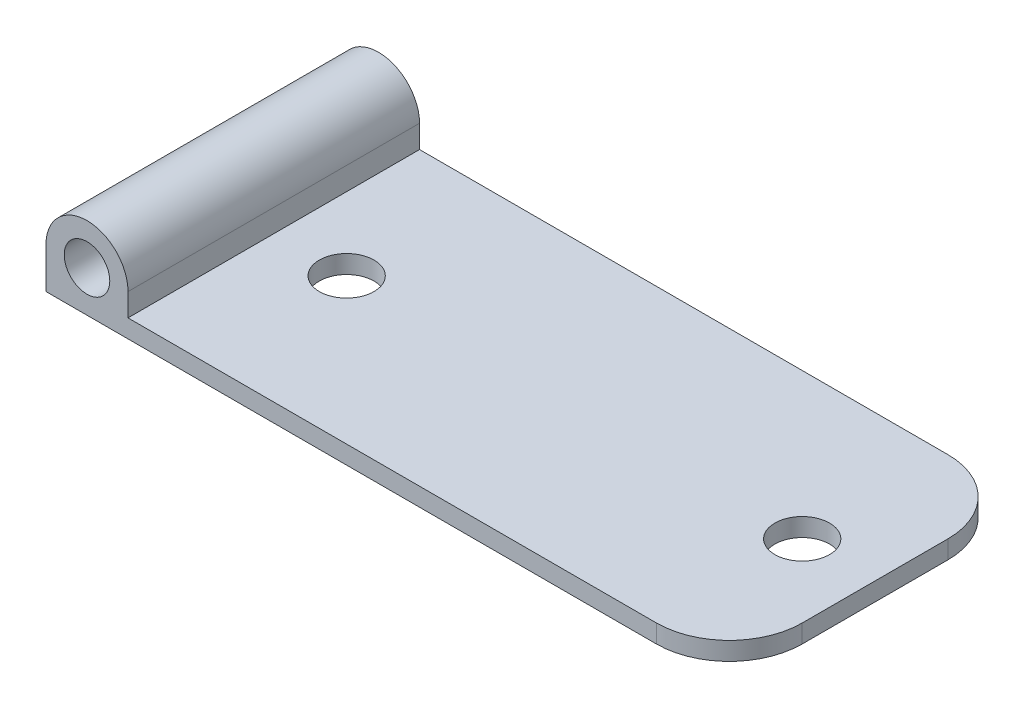
ISO-10303-21;
HEADER;
FILE_DESCRIPTION(('STEP AP214'),'2;1');
FILE_NAME('part.step','',(''),(''),'','','');
FILE_SCHEMA(('AUTOMOTIVE_DESIGN { 1 0 10303 214 1 1 1 1 }'));
ENDSEC;
DATA;
#1=APPLICATION_CONTEXT('core data for automotive mechanical design processes');
#2=APPLICATION_PROTOCOL_DEFINITION('international standard','automotive_design',2000,#1);
#3=PRODUCT_CONTEXT('',#1,'mechanical');
#4=PRODUCT('Part','Part','',(#3));
#5=PRODUCT_RELATED_PRODUCT_CATEGORY('part','',(#4));
#6=PRODUCT_DEFINITION_FORMATION('','',#4);
#7=PRODUCT_DEFINITION_CONTEXT('part definition',#1,'design');
#8=PRODUCT_DEFINITION('design','',#6,#7);
#9=PRODUCT_DEFINITION_SHAPE('','',#8);
#10=(LENGTH_UNIT() NAMED_UNIT(*) SI_UNIT(.MILLI.,.METRE.));
#11=(NAMED_UNIT(*) PLANE_ANGLE_UNIT() SI_UNIT($,.RADIAN.));
#12=(NAMED_UNIT(*) SI_UNIT($,.STERADIAN.) SOLID_ANGLE_UNIT());
#13=UNCERTAINTY_MEASURE_WITH_UNIT(LENGTH_MEASURE(1.E-05),#10,'distance_accuracy_value','');
#14=(GEOMETRIC_REPRESENTATION_CONTEXT(3) GLOBAL_UNCERTAINTY_ASSIGNED_CONTEXT((#13)) GLOBAL_UNIT_ASSIGNED_CONTEXT((#10,
#11,#12)) REPRESENTATION_CONTEXT('',''));
#15=CARTESIAN_POINT('',(0.,0.,0.));
#16=DIRECTION('',(0.,0.,1.));
#17=DIRECTION('',(1.,0.,0.));
#18=AXIS2_PLACEMENT_3D('',#15,#16,#17);
#19=CARTESIAN_POINT('',(-7.14375,0.,50.8));
#20=DIRECTION('',(1.,0.,0.));
#21=DIRECTION('',(0.,1.,0.));
#22=AXIS2_PLACEMENT_3D('',#19,#20,#21);
#23=PLANE('',#22);
#24=DIRECTION('',(0.,-1.,0.));
#25=VECTOR('',#24,1.);
#26=CARTESIAN_POINT('',(-7.14375,0.,0.));
#27=LINE('',#26,#25);
#28=CARTESIAN_POINT('',(-7.14375,0.,0.));
#29=VERTEX_POINT('',#28);
#30=CARTESIAN_POINT('',(-7.14375,-7.14375,0.));
#31=VERTEX_POINT('',#30);
#32=EDGE_CURVE('E126',#29,#31,#27,.T.);
#33=ORIENTED_EDGE('',*,*,#32,.T.);
#34=DIRECTION('',(0.,0.,-1.));
#35=VECTOR('',#34,1.);
#36=CARTESIAN_POINT('',(-7.14375,-7.14375,50.8));
#37=LINE('',#36,#35);
#38=CARTESIAN_POINT('',(-7.14375,-7.14375,50.8));
#39=VERTEX_POINT('',#38);
#40=EDGE_CURVE('E109',#39,#31,#37,.T.);
#41=ORIENTED_EDGE('',*,*,#40,.F.);
#42=DIRECTION('',(0.,-1.,0.));
#43=VECTOR('',#42,1.);
#44=CARTESIAN_POINT('',(-7.14375,0.,50.8));
#45=LINE('',#44,#43);
#46=CARTESIAN_POINT('',(-7.14375,0.,50.8));
#47=VERTEX_POINT('',#46);
#48=EDGE_CURVE('E114',#47,#39,#45,.T.);
#49=ORIENTED_EDGE('',*,*,#48,.F.);
#50=DIRECTION('',(0.,0.,-1.));
#51=VECTOR('',#50,1.);
#52=CARTESIAN_POINT('',(-7.14375,0.,50.8));
#53=LINE('',#52,#51);
#54=EDGE_CURVE('E172',#47,#29,#53,.T.);
#55=ORIENTED_EDGE('',*,*,#54,.T.);
#56=EDGE_LOOP('',(#33,#41,#49,#55));
#57=FACE_BOUND('',#56,.T.);
#58=ADVANCED_FACE('F38',(#57),#23,.F.);
#59=CARTESIAN_POINT('',(0.,-7.14375,50.8));
#60=DIRECTION('',(0.,1.,0.));
#61=DIRECTION('',(-1.,0.,0.));
#62=AXIS2_PLACEMENT_3D('',#59,#60,#61);
#63=PLANE('',#62);
#64=CARTESIAN_POINT('',(19.84375,-7.14375000000001,25.4));
#65=DIRECTION('',(0.,1.,0.));
#66=DIRECTION('',(-1.,0.,0.));
#67=AXIS2_PLACEMENT_3D('',#64,#65,#66);
#68=CIRCLE('',#67,4.76250000000001);
#69=CARTESIAN_POINT('',(15.08125,-7.14375000000001,25.4));
#70=VERTEX_POINT('',#69);
#71=EDGE_CURVE('E176',#70,#70,#68,.T.);
#72=ORIENTED_EDGE('',*,*,#71,.T.);
#73=EDGE_LOOP('',(#72));
#74=FACE_BOUND('',#73,.T.);
#75=CARTESIAN_POINT('',(99.21875,-7.14375000000005,25.4));
#76=DIRECTION('',(0.,1.,0.));
#77=DIRECTION('',(-1.,0.,0.));
#78=AXIS2_PLACEMENT_3D('',#75,#76,#77);
#79=CIRCLE('',#78,4.7625);
#80=CARTESIAN_POINT('',(94.45625,-7.14375000000005,25.4));
#81=VERTEX_POINT('',#80);
#82=EDGE_CURVE('E334',#81,#81,#79,.T.);
#83=ORIENTED_EDGE('',*,*,#82,.T.);
#84=EDGE_LOOP('',(#83));
#85=FACE_BOUND('',#84,.T.);
#86=DIRECTION('',(1.,0.,0.));
#87=VECTOR('',#86,1.);
#88=CARTESIAN_POINT('',(0.,-7.14375,0.));
#89=LINE('',#88,#87);
#90=CARTESIAN_POINT('',(99.21875,-7.14375000000005,0.));
#91=VERTEX_POINT('',#90);
#92=EDGE_CURVE('E158',#31,#91,#89,.T.);
#93=ORIENTED_EDGE('',*,*,#92,.T.);
#94=CARTESIAN_POINT('',(99.21875,-7.14375000000005,12.7));
#95=DIRECTION('',(0.,1.,0.));
#96=DIRECTION('',(-1.,0.,0.));
#97=AXIS2_PLACEMENT_3D('',#94,#95,#96);
#98=CIRCLE('',#97,12.7);
#99=CARTESIAN_POINT('',(111.91875,-7.14374999999999,12.7));
#100=VERTEX_POINT('',#99);
#101=EDGE_CURVE('E137',#91,#100,#98,.F.);
#102=ORIENTED_EDGE('',*,*,#101,.T.);
#103=DIRECTION('',(0.,0.,-1.));
#104=VECTOR('',#103,1.);
#105=CARTESIAN_POINT('',(111.91875,-7.14374999999999,50.8));
#106=LINE('',#105,#104);
#107=CARTESIAN_POINT('',(111.91875,-7.14374999999999,38.1));
#108=VERTEX_POINT('',#107);
#109=EDGE_CURVE('E128',#108,#100,#106,.T.);
#110=ORIENTED_EDGE('',*,*,#109,.F.);
#111=CARTESIAN_POINT('',(99.21875,-7.14375000000005,38.1));
#112=DIRECTION('',(0.,1.,0.));
#113=DIRECTION('',(-1.,0.,0.));
#114=AXIS2_PLACEMENT_3D('',#111,#112,#113);
#115=CIRCLE('',#114,12.7);
#116=CARTESIAN_POINT('',(99.21875,-7.14375000000005,50.8));
#117=VERTEX_POINT('',#116);
#118=EDGE_CURVE('E112',#108,#117,#115,.F.);
#119=ORIENTED_EDGE('',*,*,#118,.T.);
#120=DIRECTION('',(1.,0.,0.));
#121=VECTOR('',#120,1.);
#122=CARTESIAN_POINT('',(0.,-7.14375,50.8));
#123=LINE('',#122,#121);
#124=EDGE_CURVE('E104',#39,#117,#123,.T.);
#125=ORIENTED_EDGE('',*,*,#124,.F.);
#126=ORIENTED_EDGE('',*,*,#40,.T.);
#127=EDGE_LOOP('',(#93,#102,#110,#119,#125,#126));
#128=FACE_BOUND('',#127,.T.);
#129=ADVANCED_FACE('F107',(#74,#85,#128),#63,.F.);
#130=CARTESIAN_POINT('',(111.91875,0.,50.8));
#131=DIRECTION('',(1.,0.,0.));
#132=DIRECTION('',(0.,0.,-1.));
#133=AXIS2_PLACEMENT_3D('',#130,#131,#132);
#134=PLANE('',#133);
#135=ORIENTED_EDGE('',*,*,#109,.T.);
#136=DIRECTION('',(0.,-1.,0.));
#137=VECTOR('',#136,1.);
#138=CARTESIAN_POINT('',(111.91875,-3.96875,12.7));
#139=LINE('',#138,#137);
#140=CARTESIAN_POINT('',(111.91875,-3.96875,12.7));
#141=VERTEX_POINT('',#140);
#142=EDGE_CURVE('E59',#100,#141,#139,.F.);
#143=ORIENTED_EDGE('',*,*,#142,.T.);
#144=DIRECTION('',(0.,0.,-1.));
#145=VECTOR('',#144,1.);
#146=CARTESIAN_POINT('',(111.91875,-3.96875,50.8));
#147=LINE('',#146,#145);
#148=CARTESIAN_POINT('',(111.91875,-3.96875,38.1));
#149=VERTEX_POINT('',#148);
#150=EDGE_CURVE('E132',#149,#141,#147,.T.);
#151=ORIENTED_EDGE('',*,*,#150,.F.);
#152=DIRECTION('',(0.,-1.,0.));
#153=VECTOR('',#152,1.);
#154=CARTESIAN_POINT('',(111.91875,0.,38.1));
#155=LINE('',#154,#153);
#156=EDGE_CURVE('E139',#149,#108,#155,.T.);
#157=ORIENTED_EDGE('',*,*,#156,.T.);
#158=EDGE_LOOP('',(#135,#143,#151,#157));
#159=FACE_BOUND('',#158,.T.);
#160=ADVANCED_FACE('F161',(#159),#134,.T.);
#161=CARTESIAN_POINT('',(0.,-3.96875,50.8));
#162=DIRECTION('',(0.,1.,0.));
#163=DIRECTION('',(0.,0.,1.));
#164=AXIS2_PLACEMENT_3D('',#161,#162,#163);
#165=PLANE('',#164);
#166=CARTESIAN_POINT('',(19.84375,-3.96875,25.4));
#167=DIRECTION('',(0.,1.,0.));
#168=DIRECTION('',(-1.,0.,0.));
#169=AXIS2_PLACEMENT_3D('',#166,#167,#168);
#170=CIRCLE('',#169,4.76250000000001);
#171=CARTESIAN_POINT('',(15.08125,-3.96875,25.4));
#172=VERTEX_POINT('',#171);
#173=EDGE_CURVE('E329',#172,#172,#170,.T.);
#174=ORIENTED_EDGE('',*,*,#173,.F.);
#175=EDGE_LOOP('',(#174));
#176=FACE_BOUND('',#175,.T.);
#177=CARTESIAN_POINT('',(99.21875,-3.96875000000001,25.4));
#178=DIRECTION('',(0.,1.,0.));
#179=DIRECTION('',(-1.,0.,0.));
#180=AXIS2_PLACEMENT_3D('',#177,#178,#179);
#181=CIRCLE('',#180,4.7625);
#182=CARTESIAN_POINT('',(94.45625,-3.96875000000001,25.4));
#183=VERTEX_POINT('',#182);
#184=EDGE_CURVE('E332',#183,#183,#181,.T.);
#185=ORIENTED_EDGE('',*,*,#184,.F.);
#186=EDGE_LOOP('',(#185));
#187=FACE_BOUND('',#186,.T.);
#188=ORIENTED_EDGE('',*,*,#150,.T.);
#189=CARTESIAN_POINT('',(99.21875,-3.96875,12.7));
#190=DIRECTION('',(0.,1.,0.));
#191=DIRECTION('',(0.,0.,1.));
#192=AXIS2_PLACEMENT_3D('',#189,#190,#191);
#193=CIRCLE('',#192,12.7);
#194=CARTESIAN_POINT('',(99.21875,-3.96875,0.));
#195=VERTEX_POINT('',#194);
#196=EDGE_CURVE('E46',#141,#195,#193,.T.);
#197=ORIENTED_EDGE('',*,*,#196,.T.);
#198=DIRECTION('',(1.,0.,0.));
#199=VECTOR('',#198,1.);
#200=CARTESIAN_POINT('',(0.,-3.96875,0.));
#201=LINE('',#200,#199);
#202=CARTESIAN_POINT('',(7.14375,-3.96875,0.));
#203=VERTEX_POINT('',#202);
#204=EDGE_CURVE('E149',#203,#195,#201,.T.);
#205=ORIENTED_EDGE('',*,*,#204,.F.);
#206=DIRECTION('',(0.,0.,-1.));
#207=VECTOR('',#206,1.);
#208=CARTESIAN_POINT('',(7.14375,-3.96875,50.8));
#209=LINE('',#208,#207);
#210=CARTESIAN_POINT('',(7.14375,-3.96875,50.8));
#211=VERTEX_POINT('',#210);
#212=EDGE_CURVE('E165',#211,#203,#209,.T.);
#213=ORIENTED_EDGE('',*,*,#212,.F.);
#214=DIRECTION('',(1.,0.,0.));
#215=VECTOR('',#214,1.);
#216=CARTESIAN_POINT('',(0.,-3.96875,50.8));
#217=LINE('',#216,#215);
#218=CARTESIAN_POINT('',(99.21875,-3.96875,50.8));
#219=VERTEX_POINT('',#218);
#220=EDGE_CURVE('E113',#211,#219,#217,.T.);
#221=ORIENTED_EDGE('',*,*,#220,.T.);
#222=CARTESIAN_POINT('',(99.21875,-3.96875,38.1));
#223=DIRECTION('',(0.,1.,0.));
#224=DIRECTION('',(0.,0.,1.));
#225=AXIS2_PLACEMENT_3D('',#222,#223,#224);
#226=CIRCLE('',#225,12.7);
#227=EDGE_CURVE('E143',#219,#149,#226,.T.);
#228=ORIENTED_EDGE('',*,*,#227,.T.);
#229=EDGE_LOOP('',(#188,#197,#205,#213,#221,#228));
#230=FACE_BOUND('',#229,.T.);
#231=ADVANCED_FACE('F148',(#176,#187,#230),#165,.T.);
#232=CARTESIAN_POINT('',(7.14375,0.,50.8));
#233=DIRECTION('',(1.,0.,0.));
#234=DIRECTION('',(0.,1.,0.));
#235=AXIS2_PLACEMENT_3D('',#232,#233,#234);
#236=PLANE('',#235);
#237=DIRECTION('',(0.,-1.,0.));
#238=VECTOR('',#237,1.);
#239=CARTESIAN_POINT('',(7.14375,0.,0.));
#240=LINE('',#239,#238);
#241=CARTESIAN_POINT('',(7.14375,0.,0.));
#242=VERTEX_POINT('',#241);
#243=EDGE_CURVE('E157',#242,#203,#240,.T.);
#244=ORIENTED_EDGE('',*,*,#243,.F.);
#245=DIRECTION('',(0.,0.,-1.));
#246=VECTOR('',#245,1.);
#247=CARTESIAN_POINT('',(7.14375,0.,50.8));
#248=LINE('',#247,#246);
#249=CARTESIAN_POINT('',(7.14375,0.,50.8));
#250=VERTEX_POINT('',#249);
#251=EDGE_CURVE('E183',#250,#242,#248,.T.);
#252=ORIENTED_EDGE('',*,*,#251,.F.);
#253=DIRECTION('',(0.,-1.,0.));
#254=VECTOR('',#253,1.);
#255=CARTESIAN_POINT('',(7.14375,0.,50.8));
#256=LINE('',#255,#254);
#257=EDGE_CURVE('E167',#250,#211,#256,.T.);
#258=ORIENTED_EDGE('',*,*,#257,.T.);
#259=ORIENTED_EDGE('',*,*,#212,.T.);
#260=EDGE_LOOP('',(#244,#252,#258,#259));
#261=FACE_BOUND('',#260,.T.);
#262=ADVANCED_FACE('F186',(#261),#236,.T.);
#263=CARTESIAN_POINT('',(0.,0.,50.8));
#264=DIRECTION('',(0.,0.,-1.));
#265=DIRECTION('',(-1.,0.,0.));
#266=AXIS2_PLACEMENT_3D('',#263,#264,#265);
#267=CYLINDRICAL_SURFACE('',#266,3.96875);
#268=CARTESIAN_POINT('',(0.,0.,50.8));
#269=DIRECTION('',(0.,0.,1.));
#270=DIRECTION('',(1.,0.,0.));
#271=AXIS2_PLACEMENT_3D('',#268,#269,#270);
#272=CIRCLE('',#271,3.96875);
#273=CARTESIAN_POINT('',(3.96874999999999,0.,50.8));
#274=VERTEX_POINT('',#273);
#275=EDGE_CURVE('E123',#274,#274,#272,.T.);
#276=ORIENTED_EDGE('',*,*,#275,.T.);
#277=EDGE_LOOP('',(#276));
#278=FACE_BOUND('',#277,.T.);
#279=CARTESIAN_POINT('',(0.,0.,0.));
#280=DIRECTION('',(0.,0.,1.));
#281=DIRECTION('',(1.,0.,0.));
#282=AXIS2_PLACEMENT_3D('',#279,#280,#281);
#283=CIRCLE('',#282,3.96875);
#284=CARTESIAN_POINT('',(3.96874999999999,0.,0.));
#285=VERTEX_POINT('',#284);
#286=EDGE_CURVE('E173',#285,#285,#283,.T.);
#287=ORIENTED_EDGE('',*,*,#286,.F.);
#288=EDGE_LOOP('',(#287));
#289=FACE_BOUND('',#288,.T.);
#290=ADVANCED_FACE('F191',(#278,#289),#267,.F.);
#291=CARTESIAN_POINT('',(0.,0.,50.8));
#292=DIRECTION('',(0.,0.,-1.));
#293=DIRECTION('',(-1.,0.,0.));
#294=AXIS2_PLACEMENT_3D('',#291,#292,#293);
#295=CYLINDRICAL_SURFACE('',#294,7.14375);
#296=CARTESIAN_POINT('',(0.,0.,0.));
#297=DIRECTION('',(0.,0.,1.));
#298=DIRECTION('',(1.,0.,0.));
#299=AXIS2_PLACEMENT_3D('',#296,#297,#298);
#300=CIRCLE('',#299,7.14375);
#301=EDGE_CURVE('E180',#29,#242,#300,.F.);
#302=ORIENTED_EDGE('',*,*,#301,.F.);
#303=ORIENTED_EDGE('',*,*,#54,.F.);
#304=CARTESIAN_POINT('',(0.,0.,50.8));
#305=DIRECTION('',(0.,0.,1.));
#306=DIRECTION('',(1.,0.,0.));
#307=AXIS2_PLACEMENT_3D('',#304,#305,#306);
#308=CIRCLE('',#307,7.14375);
#309=EDGE_CURVE('E121',#47,#250,#308,.F.);
#310=ORIENTED_EDGE('',*,*,#309,.T.);
#311=ORIENTED_EDGE('',*,*,#251,.T.);
#312=EDGE_LOOP('',(#302,#303,#310,#311));
#313=FACE_BOUND('',#312,.T.);
#314=ADVANCED_FACE('F189',(#313),#295,.T.);
#315=CARTESIAN_POINT('',(0.,0.,50.8));
#316=DIRECTION('',(0.,0.,1.));
#317=DIRECTION('',(1.,0.,0.));
#318=AXIS2_PLACEMENT_3D('',#315,#316,#317);
#319=PLANE('',#318);
#320=ORIENTED_EDGE('',*,*,#275,.F.);
#321=EDGE_LOOP('',(#320));
#322=FACE_BOUND('',#321,.T.);
#323=ORIENTED_EDGE('',*,*,#124,.T.);
#324=DIRECTION('',(0.,-1.,0.));
#325=VECTOR('',#324,1.);
#326=CARTESIAN_POINT('',(99.21875,0.,50.8));
#327=LINE('',#326,#325);
#328=EDGE_CURVE('E11',#117,#219,#327,.F.);
#329=ORIENTED_EDGE('',*,*,#328,.T.);
#330=ORIENTED_EDGE('',*,*,#220,.F.);
#331=ORIENTED_EDGE('',*,*,#257,.F.);
#332=ORIENTED_EDGE('',*,*,#309,.F.);
#333=ORIENTED_EDGE('',*,*,#48,.T.);
#334=EDGE_LOOP('',(#323,#329,#330,#331,#332,#333));
#335=FACE_BOUND('',#334,.T.);
#336=ADVANCED_FACE('F118',(#322,#335),#319,.T.);
#337=CARTESIAN_POINT('',(0.,0.,0.));
#338=DIRECTION('',(0.,0.,1.));
#339=DIRECTION('',(1.,0.,0.));
#340=AXIS2_PLACEMENT_3D('',#337,#338,#339);
#341=PLANE('',#340);
#342=ORIENTED_EDGE('',*,*,#286,.T.);
#343=EDGE_LOOP('',(#342));
#344=FACE_BOUND('',#343,.T.);
#345=ORIENTED_EDGE('',*,*,#204,.T.);
#346=DIRECTION('',(0.,-1.,0.));
#347=VECTOR('',#346,1.);
#348=CARTESIAN_POINT('',(99.21875,-7.14374999999999,0.));
#349=LINE('',#348,#347);
#350=EDGE_CURVE('E127',#195,#91,#349,.T.);
#351=ORIENTED_EDGE('',*,*,#350,.T.);
#352=ORIENTED_EDGE('',*,*,#92,.F.);
#353=ORIENTED_EDGE('',*,*,#32,.F.);
#354=ORIENTED_EDGE('',*,*,#301,.T.);
#355=ORIENTED_EDGE('',*,*,#243,.T.);
#356=EDGE_LOOP('',(#345,#351,#352,#353,#354,#355));
#357=FACE_BOUND('',#356,.T.);
#358=ADVANCED_FACE('F154',(#344,#357),#341,.F.);
#359=CARTESIAN_POINT('',(99.21875,-16.66875,25.4));
#360=DIRECTION('',(0.,1.,0.));
#361=DIRECTION('',(-1.,0.,0.));
#362=AXIS2_PLACEMENT_3D('',#359,#360,#361);
#363=CYLINDRICAL_SURFACE('',#362,4.7625);
#364=ORIENTED_EDGE('',*,*,#184,.T.);
#365=EDGE_LOOP('',(#364));
#366=FACE_BOUND('',#365,.T.);
#367=ORIENTED_EDGE('',*,*,#82,.F.);
#368=EDGE_LOOP('',(#367));
#369=FACE_BOUND('',#368,.T.);
#370=ADVANCED_FACE('F217',(#366,#369),#363,.F.);
#371=CARTESIAN_POINT('',(19.84375,-16.66875,25.4));
#372=DIRECTION('',(0.,1.,0.));
#373=DIRECTION('',(-1.,0.,0.));
#374=AXIS2_PLACEMENT_3D('',#371,#372,#373);
#375=CYLINDRICAL_SURFACE('',#374,4.76250000000001);
#376=ORIENTED_EDGE('',*,*,#173,.T.);
#377=EDGE_LOOP('',(#376));
#378=FACE_BOUND('',#377,.T.);
#379=ORIENTED_EDGE('',*,*,#71,.F.);
#380=EDGE_LOOP('',(#379));
#381=FACE_BOUND('',#380,.T.);
#382=ADVANCED_FACE('F212',(#378,#381),#375,.F.);
#383=CARTESIAN_POINT('',(99.21875,0.,12.7));
#384=DIRECTION('',(0.,1.,0.));
#385=DIRECTION('',(0.,0.,1.));
#386=AXIS2_PLACEMENT_3D('',#383,#384,#385);
#387=CYLINDRICAL_SURFACE('',#386,12.7);
#388=ORIENTED_EDGE('',*,*,#196,.F.);
#389=ORIENTED_EDGE('',*,*,#142,.F.);
#390=ORIENTED_EDGE('',*,*,#101,.F.);
#391=ORIENTED_EDGE('',*,*,#350,.F.);
#392=EDGE_LOOP('',(#388,#389,#390,#391));
#393=FACE_BOUND('',#392,.T.);
#394=ADVANCED_FACE('F160',(#393),#387,.T.);
#395=CARTESIAN_POINT('',(99.21875,0.,38.1));
#396=DIRECTION('',(0.,-1.,0.));
#397=DIRECTION('',(0.,0.,-1.));
#398=AXIS2_PLACEMENT_3D('',#395,#396,#397);
#399=CYLINDRICAL_SURFACE('',#398,12.7);
#400=ORIENTED_EDGE('',*,*,#227,.F.);
#401=ORIENTED_EDGE('',*,*,#328,.F.);
#402=ORIENTED_EDGE('',*,*,#118,.F.);
#403=ORIENTED_EDGE('',*,*,#156,.F.);
#404=EDGE_LOOP('',(#400,#401,#402,#403));
#405=FACE_BOUND('',#404,.T.);
#406=ADVANCED_FACE('F40',(#405),#399,.T.);
#407=CLOSED_SHELL('',(#58,#129,#160,#231,#262,#290,#314,#336,#358,#370,#382,#394,#406));
#408=MANIFOLD_SOLID_BREP('B2',#407);
#409=ADVANCED_BREP_SHAPE_REPRESENTATION('',(#18,#408),#14);
#410=SHAPE_DEFINITION_REPRESENTATION(#9,#409);
ENDSEC;
END-ISO-10303-21;
